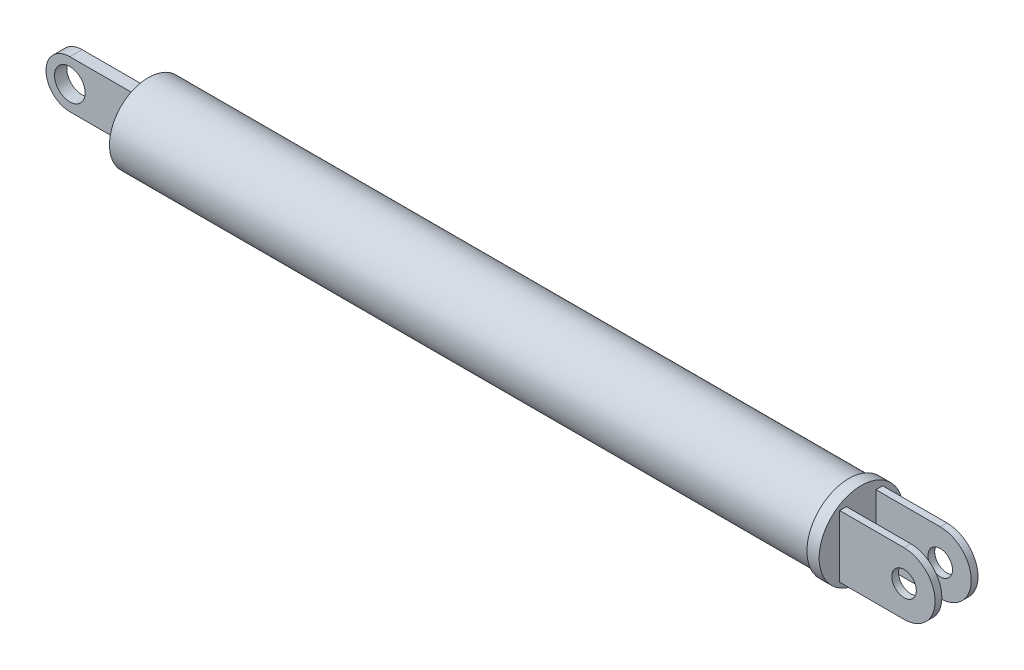
ISO-10303-21;
HEADER;
FILE_DESCRIPTION(('STEP AP214'),'2;1');
FILE_NAME('part.step','',(''),(''),'','','');
FILE_SCHEMA(('AUTOMOTIVE_DESIGN { 1 0 10303 214 1 1 1 1 }'));
ENDSEC;
DATA;
#1=APPLICATION_CONTEXT('core data for automotive mechanical design processes');
#2=APPLICATION_PROTOCOL_DEFINITION('international standard','automotive_design',2000,#1);
#3=PRODUCT_CONTEXT('',#1,'mechanical');
#4=PRODUCT('Part','Part','',(#3));
#5=PRODUCT_RELATED_PRODUCT_CATEGORY('part','',(#4));
#6=PRODUCT_DEFINITION_FORMATION('','',#4);
#7=PRODUCT_DEFINITION_CONTEXT('part definition',#1,'design');
#8=PRODUCT_DEFINITION('design','',#6,#7);
#9=PRODUCT_DEFINITION_SHAPE('','',#8);
#10=(LENGTH_UNIT() NAMED_UNIT(*) SI_UNIT(.MILLI.,.METRE.));
#11=(NAMED_UNIT(*) PLANE_ANGLE_UNIT() SI_UNIT($,.RADIAN.));
#12=(NAMED_UNIT(*) SI_UNIT($,.STERADIAN.) SOLID_ANGLE_UNIT());
#13=UNCERTAINTY_MEASURE_WITH_UNIT(LENGTH_MEASURE(1.E-05),#10,'distance_accuracy_value','');
#14=(GEOMETRIC_REPRESENTATION_CONTEXT(3) GLOBAL_UNCERTAINTY_ASSIGNED_CONTEXT((#13)) GLOBAL_UNIT_ASSIGNED_CONTEXT((#10,
#11,#12)) REPRESENTATION_CONTEXT('',''));
#15=CARTESIAN_POINT('',(0.,0.,0.));
#16=DIRECTION('',(0.,0.,1.));
#17=DIRECTION('',(1.,0.,0.));
#18=AXIS2_PLACEMENT_3D('',#15,#16,#17);
#19=CARTESIAN_POINT('',(232.6,-10.1328519164728,7.));
#20=DIRECTION('',(0.,1.,0.));
#21=DIRECTION('',(0.,0.,1.));
#22=AXIS2_PLACEMENT_3D('',#19,#20,#21);
#23=PLANE('',#22);
#24=DIRECTION('',(0.,0.,-1.));
#25=VECTOR('',#24,1.);
#26=CARTESIAN_POINT('',(253.6,-10.1328519164728,7.));
#27=LINE('',#26,#25);
#28=CARTESIAN_POINT('',(253.6,-10.1328519164728,-4.80121317375937));
#29=VERTEX_POINT('',#28);
#30=CARTESIAN_POINT('',(253.6,-10.1328519164728,-7.));
#31=VERTEX_POINT('',#30);
#32=EDGE_CURVE('E246',#29,#31,#27,.T.);
#33=ORIENTED_EDGE('',*,*,#32,.F.);
#34=DIRECTION('',(-1.,0.,0.));
#35=VECTOR('',#34,1.);
#36=CARTESIAN_POINT('',(232.6,-10.1328519164728,-4.80121317375936));
#37=LINE('',#36,#35);
#38=CARTESIAN_POINT('',(232.6,-10.1328519164728,-4.80121317375936));
#39=VERTEX_POINT('',#38);
#40=EDGE_CURVE('E215',#29,#39,#37,.T.);
#41=ORIENTED_EDGE('',*,*,#40,.T.);
#42=DIRECTION('',(0.,0.,-1.));
#43=VECTOR('',#42,1.);
#44=CARTESIAN_POINT('',(232.6,-10.1328519164728,7.));
#45=LINE('',#44,#43);
#46=CARTESIAN_POINT('',(232.6,-10.1328519164728,-7.));
#47=VERTEX_POINT('',#46);
#48=EDGE_CURVE('E148',#39,#47,#45,.T.);
#49=ORIENTED_EDGE('',*,*,#48,.T.);
#50=DIRECTION('',(1.,0.,0.));
#51=VECTOR('',#50,1.);
#52=CARTESIAN_POINT('',(232.6,-10.1328519164728,-7.));
#53=LINE('',#52,#51);
#54=EDGE_CURVE('E227',#47,#31,#53,.T.);
#55=ORIENTED_EDGE('',*,*,#54,.T.);
#56=EDGE_LOOP('',(#33,#41,#49,#55));
#57=FACE_BOUND('',#56,.T.);
#58=ADVANCED_FACE('F33',(#57),#23,.F.);
#59=CARTESIAN_POINT('',(253.6,0.,7.));
#60=DIRECTION('',(0.,0.,-1.));
#61=DIRECTION('',(-1.,0.,0.));
#62=AXIS2_PLACEMENT_3D('',#59,#60,#61);
#63=CYLINDRICAL_SURFACE('',#62,10.1328519164728);
#64=DIRECTION('',(0.,0.,-1.));
#65=VECTOR('',#64,1.);
#66=CARTESIAN_POINT('',(253.6,10.1328519164728,7.));
#67=LINE('',#66,#65);
#68=CARTESIAN_POINT('',(253.6,10.1328519164728,-4.80121317375937));
#69=VERTEX_POINT('',#68);
#70=CARTESIAN_POINT('',(253.6,10.1328519164728,-7.));
#71=VERTEX_POINT('',#70);
#72=EDGE_CURVE('E243',#69,#71,#67,.T.);
#73=ORIENTED_EDGE('',*,*,#72,.F.);
#74=CARTESIAN_POINT('',(253.6,0.,-4.80121317375937));
#75=DIRECTION('',(0.,0.,-1.));
#76=DIRECTION('',(-1.,0.,0.));
#77=AXIS2_PLACEMENT_3D('',#74,#75,#76);
#78=CIRCLE('',#77,10.1328519164728);
#79=EDGE_CURVE('E212',#69,#29,#78,.T.);
#80=ORIENTED_EDGE('',*,*,#79,.T.);
#81=ORIENTED_EDGE('',*,*,#32,.T.);
#82=CARTESIAN_POINT('',(253.6,0.,-7.));
#83=DIRECTION('',(0.,0.,1.));
#84=DIRECTION('',(-1.,0.,0.));
#85=AXIS2_PLACEMENT_3D('',#82,#83,#84);
#86=CIRCLE('',#85,10.1328519164728);
#87=EDGE_CURVE('E230',#31,#71,#86,.T.);
#88=ORIENTED_EDGE('',*,*,#87,.T.);
#89=EDGE_LOOP('',(#73,#80,#81,#88));
#90=FACE_BOUND('',#89,.T.);
#91=ADVANCED_FACE('F256',(#90),#63,.T.);
#92=CARTESIAN_POINT('',(232.6,10.1328519164728,7.));
#93=DIRECTION('',(0.,-1.,0.));
#94=DIRECTION('',(0.,0.,-1.));
#95=AXIS2_PLACEMENT_3D('',#92,#93,#94);
#96=PLANE('',#95);
#97=DIRECTION('',(0.,0.,-1.));
#98=VECTOR('',#97,1.);
#99=CARTESIAN_POINT('',(232.6,10.1328519164728,7.));
#100=LINE('',#99,#98);
#101=CARTESIAN_POINT('',(232.6,10.1328519164728,-4.80121317375936));
#102=VERTEX_POINT('',#101);
#103=CARTESIAN_POINT('',(232.6,10.1328519164728,-7.));
#104=VERTEX_POINT('',#103);
#105=EDGE_CURVE('E58',#102,#104,#100,.T.);
#106=ORIENTED_EDGE('',*,*,#105,.F.);
#107=DIRECTION('',(1.,0.,0.));
#108=VECTOR('',#107,1.);
#109=CARTESIAN_POINT('',(232.6,10.1328519164728,-4.80121317375936));
#110=LINE('',#109,#108);
#111=EDGE_CURVE('E209',#102,#69,#110,.T.);
#112=ORIENTED_EDGE('',*,*,#111,.T.);
#113=ORIENTED_EDGE('',*,*,#72,.T.);
#114=DIRECTION('',(-1.,0.,0.));
#115=VECTOR('',#114,1.);
#116=CARTESIAN_POINT('',(232.6,10.1328519164728,-7.));
#117=LINE('',#116,#115);
#118=EDGE_CURVE('E233',#71,#104,#117,.T.);
#119=ORIENTED_EDGE('',*,*,#118,.T.);
#120=EDGE_LOOP('',(#106,#112,#113,#119));
#121=FACE_BOUND('',#120,.T.);
#122=ADVANCED_FACE('F252',(#121),#96,.F.);
#123=CARTESIAN_POINT('',(253.6,0.,7.));
#124=DIRECTION('',(0.,0.,-1.));
#125=DIRECTION('',(-1.,0.,0.));
#126=AXIS2_PLACEMENT_3D('',#123,#124,#125);
#127=CYLINDRICAL_SURFACE('',#126,3.99999999999999);
#128=CARTESIAN_POINT('',(253.6,0.,-4.80121317375937));
#129=DIRECTION('',(0.,0.,-1.));
#130=DIRECTION('',(-1.,0.,0.));
#131=AXIS2_PLACEMENT_3D('',#128,#129,#130);
#132=CIRCLE('',#131,3.99999999999999);
#133=CARTESIAN_POINT('',(249.6,0.,-4.80121317375937));
#134=VERTEX_POINT('',#133);
#135=EDGE_CURVE('E37',#134,#134,#132,.T.);
#136=ORIENTED_EDGE('',*,*,#135,.F.);
#137=EDGE_LOOP('',(#136));
#138=FACE_BOUND('',#137,.T.);
#139=CARTESIAN_POINT('',(253.6,0.,-7.));
#140=DIRECTION('',(0.,0.,1.));
#141=DIRECTION('',(1.,0.,0.));
#142=AXIS2_PLACEMENT_3D('',#139,#140,#141);
#143=CIRCLE('',#142,3.99999999999999);
#144=CARTESIAN_POINT('',(257.6,0.,-7.));
#145=VERTEX_POINT('',#144);
#146=EDGE_CURVE('E218',#145,#145,#143,.T.);
#147=ORIENTED_EDGE('',*,*,#146,.F.);
#148=EDGE_LOOP('',(#147));
#149=FACE_BOUND('',#148,.T.);
#150=ADVANCED_FACE('F277',(#138,#149),#127,.F.);
#151=CARTESIAN_POINT('',(232.6,0.,0.));
#152=DIRECTION('',(1.,0.,0.));
#153=DIRECTION('',(0.,0.,-1.));
#154=AXIS2_PLACEMENT_3D('',#151,#152,#153);
#155=PLANE('',#154);
#156=ORIENTED_EDGE('',*,*,#48,.F.);
#157=DIRECTION('',(0.,1.,0.));
#158=VECTOR('',#157,1.);
#159=CARTESIAN_POINT('',(232.6,-13.7,-4.80121317375936));
#160=LINE('',#159,#158);
#161=EDGE_CURVE('E142',#39,#102,#160,.T.);
#162=ORIENTED_EDGE('',*,*,#161,.T.);
#163=ORIENTED_EDGE('',*,*,#105,.T.);
#164=DIRECTION('',(0.,-1.,0.));
#165=VECTOR('',#164,1.);
#166=CARTESIAN_POINT('',(232.6,10.1328519164728,-7.));
#167=LINE('',#166,#165);
#168=EDGE_CURVE('E225',#104,#47,#167,.T.);
#169=ORIENTED_EDGE('',*,*,#168,.T.);
#170=EDGE_LOOP('',(#156,#162,#163,#169));
#171=FACE_BOUND('',#170,.T.);
#172=CARTESIAN_POINT('',(232.6,10.1328519164728,7.));
#173=VERTEX_POINT('',#172);
#174=CARTESIAN_POINT('',(232.6,10.1328519164728,4.80121317375939));
#175=VERTEX_POINT('',#174);
#176=EDGE_CURVE('E141',#173,#175,#100,.T.);
#177=ORIENTED_EDGE('',*,*,#176,.T.);
#178=DIRECTION('',(0.,1.,0.));
#179=VECTOR('',#178,1.);
#180=CARTESIAN_POINT('',(232.6,-13.7,4.80121317375939));
#181=LINE('',#180,#179);
#182=CARTESIAN_POINT('',(232.6,-10.1328519164728,4.80121317375939));
#183=VERTEX_POINT('',#182);
#184=EDGE_CURVE('E50',#183,#175,#181,.T.);
#185=ORIENTED_EDGE('',*,*,#184,.F.);
#186=CARTESIAN_POINT('',(232.6,-10.1328519164728,7.));
#187=VERTEX_POINT('',#186);
#188=EDGE_CURVE('E139',#187,#183,#45,.T.);
#189=ORIENTED_EDGE('',*,*,#188,.F.);
#190=DIRECTION('',(0.,-1.,0.));
#191=VECTOR('',#190,1.);
#192=CARTESIAN_POINT('',(232.6,10.1328519164728,7.));
#193=LINE('',#192,#191);
#194=EDGE_CURVE('E236',#173,#187,#193,.T.);
#195=ORIENTED_EDGE('',*,*,#194,.F.);
#196=EDGE_LOOP('',(#177,#185,#189,#195));
#197=FACE_BOUND('',#196,.T.);
#198=CARTESIAN_POINT('',(232.6,0.,0.));
#199=DIRECTION('',(1.,0.,0.));
#200=DIRECTION('',(0.,0.,-1.));
#201=AXIS2_PLACEMENT_3D('',#198,#199,#200);
#202=CIRCLE('',#201,13.7);
#203=CARTESIAN_POINT('',(232.6,0.,-13.7));
#204=VERTEX_POINT('',#203);
#205=EDGE_CURVE('E152',#204,#204,#202,.T.);
#206=ORIENTED_EDGE('',*,*,#205,.T.);
#207=EDGE_LOOP('',(#206));
#208=FACE_BOUND('',#207,.T.);
#209=ADVANCED_FACE('F136',(#171,#197,#208),#155,.T.);
#210=CARTESIAN_POINT('',(0.,0.,0.));
#211=DIRECTION('',(1.,0.,0.));
#212=DIRECTION('',(0.,0.,-1.));
#213=AXIS2_PLACEMENT_3D('',#210,#211,#212);
#214=PLANE('',#213);
#215=CARTESIAN_POINT('',(0.,0.,0.));
#216=DIRECTION('',(1.,0.,0.));
#217=DIRECTION('',(0.,0.,-1.));
#218=AXIS2_PLACEMENT_3D('',#215,#216,#217);
#219=CIRCLE('',#218,12.7);
#220=CARTESIAN_POINT('',(0.,0.,-12.7));
#221=VERTEX_POINT('',#220);
#222=EDGE_CURVE('E42',#221,#221,#219,.T.);
#223=ORIENTED_EDGE('',*,*,#222,.F.);
#224=EDGE_LOOP('',(#223));
#225=FACE_BOUND('',#224,.T.);
#226=DIRECTION('',(0.,0.,-1.));
#227=VECTOR('',#226,1.);
#228=CARTESIAN_POINT('',(0.,7.77806758623207,2.));
#229=LINE('',#228,#227);
#230=CARTESIAN_POINT('',(0.,7.77806758623207,2.));
#231=VERTEX_POINT('',#230);
#232=CARTESIAN_POINT('',(0.,7.77806758623207,-2.));
#233=VERTEX_POINT('',#232);
#234=EDGE_CURVE('E194',#231,#233,#229,.T.);
#235=ORIENTED_EDGE('',*,*,#234,.F.);
#236=DIRECTION('',(0.,1.,0.));
#237=VECTOR('',#236,1.);
#238=CARTESIAN_POINT('',(0.,7.77806758623207,2.));
#239=LINE('',#238,#237);
#240=CARTESIAN_POINT('',(0.,-7.77806758623207,2.));
#241=VERTEX_POINT('',#240);
#242=EDGE_CURVE('E176',#241,#231,#239,.T.);
#243=ORIENTED_EDGE('',*,*,#242,.F.);
#244=DIRECTION('',(0.,0.,-1.));
#245=VECTOR('',#244,1.);
#246=CARTESIAN_POINT('',(0.,-7.77806758623207,2.));
#247=LINE('',#246,#245);
#248=CARTESIAN_POINT('',(0.,-7.77806758623207,-2.));
#249=VERTEX_POINT('',#248);
#250=EDGE_CURVE('E186',#241,#249,#247,.T.);
#251=ORIENTED_EDGE('',*,*,#250,.T.);
#252=DIRECTION('',(0.,1.,0.));
#253=VECTOR('',#252,1.);
#254=CARTESIAN_POINT('',(0.,7.77806758623207,-2.));
#255=LINE('',#254,#253);
#256=EDGE_CURVE('E167',#249,#233,#255,.T.);
#257=ORIENTED_EDGE('',*,*,#256,.T.);
#258=EDGE_LOOP('',(#235,#243,#251,#257));
#259=FACE_BOUND('',#258,.T.);
#260=ADVANCED_FACE('F313',(#225,#259),#214,.F.);
#261=CARTESIAN_POINT('',(228.6,0.,0.));
#262=DIRECTION('',(-1.,0.,0.));
#263=DIRECTION('',(0.,0.,1.));
#264=AXIS2_PLACEMENT_3D('',#261,#262,#263);
#265=CYLINDRICAL_SURFACE('',#264,12.7);
#266=CARTESIAN_POINT('',(228.6,0.,0.));
#267=DIRECTION('',(1.,0.,0.));
#268=DIRECTION('',(0.,0.,-1.));
#269=AXIS2_PLACEMENT_3D('',#266,#267,#268);
#270=CIRCLE('',#269,12.7);
#271=CARTESIAN_POINT('',(228.6,0.,-12.7));
#272=VERTEX_POINT('',#271);
#273=EDGE_CURVE('E11',#272,#272,#270,.T.);
#274=ORIENTED_EDGE('',*,*,#273,.F.);
#275=EDGE_LOOP('',(#274));
#276=FACE_BOUND('',#275,.T.);
#277=ORIENTED_EDGE('',*,*,#222,.T.);
#278=EDGE_LOOP('',(#277));
#279=FACE_BOUND('',#278,.T.);
#280=ADVANCED_FACE('F35',(#276,#279),#265,.T.);
#281=CARTESIAN_POINT('',(-23.6251254908995,0.,2.));
#282=DIRECTION('',(0.,0.,1.));
#283=DIRECTION('',(1.,0.,0.));
#284=AXIS2_PLACEMENT_3D('',#281,#282,#283);
#285=PLANE('',#284);
#286=ORIENTED_EDGE('',*,*,#242,.T.);
#287=DIRECTION('',(-1.,0.,0.));
#288=VECTOR('',#287,1.);
#289=CARTESIAN_POINT('',(0.,7.77806758623207,2.));
#290=LINE('',#289,#288);
#291=CARTESIAN_POINT('',(-23.6251254908995,7.77806758623206,2.));
#292=VERTEX_POINT('',#291);
#293=EDGE_CURVE('E179',#231,#292,#290,.T.);
#294=ORIENTED_EDGE('',*,*,#293,.T.);
#295=CARTESIAN_POINT('',(-23.6251254908995,0.,2.));
#296=DIRECTION('',(0.,0.,1.));
#297=DIRECTION('',(1.,0.,0.));
#298=AXIS2_PLACEMENT_3D('',#295,#296,#297);
#299=CIRCLE('',#298,7.77806758623206);
#300=CARTESIAN_POINT('',(-23.6251254908995,-7.77806758623207,2.));
#301=VERTEX_POINT('',#300);
#302=EDGE_CURVE('E181',#292,#301,#299,.T.);
#303=ORIENTED_EDGE('',*,*,#302,.T.);
#304=DIRECTION('',(1.,0.,0.));
#305=VECTOR('',#304,1.);
#306=CARTESIAN_POINT('',(0.,-7.77806758623207,2.));
#307=LINE('',#306,#305);
#308=EDGE_CURVE('E183',#301,#241,#307,.T.);
#309=ORIENTED_EDGE('',*,*,#308,.T.);
#310=EDGE_LOOP('',(#286,#294,#303,#309));
#311=FACE_BOUND('',#310,.T.);
#312=CARTESIAN_POINT('',(-23.6251254908995,0.,2.));
#313=DIRECTION('',(0.,0.,1.));
#314=DIRECTION('',(1.,0.,0.));
#315=AXIS2_PLACEMENT_3D('',#312,#313,#314);
#316=CIRCLE('',#315,5.);
#317=CARTESIAN_POINT('',(-18.6251254908995,0.,2.));
#318=VERTEX_POINT('',#317);
#319=EDGE_CURVE('E163',#318,#318,#316,.T.);
#320=ORIENTED_EDGE('',*,*,#319,.F.);
#321=EDGE_LOOP('',(#320));
#322=FACE_BOUND('',#321,.T.);
#323=ADVANCED_FACE('F336',(#311,#322),#285,.T.);
#324=CARTESIAN_POINT('',(-23.6251254908995,0.,-2.));
#325=DIRECTION('',(0.,0.,1.));
#326=DIRECTION('',(1.,0.,0.));
#327=AXIS2_PLACEMENT_3D('',#324,#325,#326);
#328=PLANE('',#327);
#329=ORIENTED_EDGE('',*,*,#256,.F.);
#330=DIRECTION('',(1.,0.,0.));
#331=VECTOR('',#330,1.);
#332=CARTESIAN_POINT('',(0.,-7.77806758623207,-2.));
#333=LINE('',#332,#331);
#334=CARTESIAN_POINT('',(-23.6251254908995,-7.77806758623207,-2.));
#335=VERTEX_POINT('',#334);
#336=EDGE_CURVE('E173',#335,#249,#333,.T.);
#337=ORIENTED_EDGE('',*,*,#336,.F.);
#338=CARTESIAN_POINT('',(-23.6251254908995,0.,-2.));
#339=DIRECTION('',(0.,0.,1.));
#340=DIRECTION('',(1.,0.,0.));
#341=AXIS2_PLACEMENT_3D('',#338,#339,#340);
#342=CIRCLE('',#341,7.77806758623206);
#343=CARTESIAN_POINT('',(-23.6251254908995,7.77806758623206,-2.));
#344=VERTEX_POINT('',#343);
#345=EDGE_CURVE('E171',#344,#335,#342,.T.);
#346=ORIENTED_EDGE('',*,*,#345,.F.);
#347=DIRECTION('',(-1.,0.,0.));
#348=VECTOR('',#347,1.);
#349=CARTESIAN_POINT('',(0.,7.77806758623207,-2.));
#350=LINE('',#349,#348);
#351=EDGE_CURVE('E169',#233,#344,#350,.T.);
#352=ORIENTED_EDGE('',*,*,#351,.F.);
#353=EDGE_LOOP('',(#329,#337,#346,#352));
#354=FACE_BOUND('',#353,.T.);
#355=CARTESIAN_POINT('',(-23.6251254908995,0.,-2.));
#356=DIRECTION('',(0.,0.,1.));
#357=DIRECTION('',(1.,0.,0.));
#358=AXIS2_PLACEMENT_3D('',#355,#356,#357);
#359=CIRCLE('',#358,5.);
#360=CARTESIAN_POINT('',(-18.6251254908995,0.,-2.));
#361=VERTEX_POINT('',#360);
#362=EDGE_CURVE('E160',#361,#361,#359,.T.);
#363=ORIENTED_EDGE('',*,*,#362,.T.);
#364=EDGE_LOOP('',(#363));
#365=FACE_BOUND('',#364,.T.);
#366=ADVANCED_FACE('F332',(#354,#365),#328,.F.);
#367=CARTESIAN_POINT('',(0.,7.77806758623207,2.));
#368=DIRECTION('',(0.,-1.,0.));
#369=DIRECTION('',(1.,0.,0.));
#370=AXIS2_PLACEMENT_3D('',#367,#368,#369);
#371=PLANE('',#370);
#372=ORIENTED_EDGE('',*,*,#351,.T.);
#373=DIRECTION('',(0.,0.,-1.));
#374=VECTOR('',#373,1.);
#375=CARTESIAN_POINT('',(-23.6251254908995,7.77806758623206,2.));
#376=LINE('',#375,#374);
#377=EDGE_CURVE('E191',#292,#344,#376,.T.);
#378=ORIENTED_EDGE('',*,*,#377,.F.);
#379=ORIENTED_EDGE('',*,*,#293,.F.);
#380=ORIENTED_EDGE('',*,*,#234,.T.);
#381=EDGE_LOOP('',(#372,#378,#379,#380));
#382=FACE_BOUND('',#381,.T.);
#383=ADVANCED_FACE('F335',(#382),#371,.F.);
#384=CARTESIAN_POINT('',(-23.6251254908995,0.,2.));
#385=DIRECTION('',(0.,0.,-1.));
#386=DIRECTION('',(-1.,0.,0.));
#387=AXIS2_PLACEMENT_3D('',#384,#385,#386);
#388=CYLINDRICAL_SURFACE('',#387,7.77806758623206);
#389=ORIENTED_EDGE('',*,*,#345,.T.);
#390=DIRECTION('',(0.,0.,-1.));
#391=VECTOR('',#390,1.);
#392=CARTESIAN_POINT('',(-23.6251254908995,-7.77806758623207,2.));
#393=LINE('',#392,#391);
#394=EDGE_CURVE('E188',#301,#335,#393,.T.);
#395=ORIENTED_EDGE('',*,*,#394,.F.);
#396=ORIENTED_EDGE('',*,*,#302,.F.);
#397=ORIENTED_EDGE('',*,*,#377,.T.);
#398=EDGE_LOOP('',(#389,#395,#396,#397));
#399=FACE_BOUND('',#398,.T.);
#400=ADVANCED_FACE('F343',(#399),#388,.T.);
#401=CARTESIAN_POINT('',(0.,-7.77806758623207,2.));
#402=DIRECTION('',(0.,1.,0.));
#403=DIRECTION('',(-1.,0.,0.));
#404=AXIS2_PLACEMENT_3D('',#401,#402,#403);
#405=PLANE('',#404);
#406=ORIENTED_EDGE('',*,*,#336,.T.);
#407=ORIENTED_EDGE('',*,*,#250,.F.);
#408=ORIENTED_EDGE('',*,*,#308,.F.);
#409=ORIENTED_EDGE('',*,*,#394,.T.);
#410=EDGE_LOOP('',(#406,#407,#408,#409));
#411=FACE_BOUND('',#410,.T.);
#412=ADVANCED_FACE('F330',(#411),#405,.F.);
#413=CARTESIAN_POINT('',(-23.6251254908995,0.,2.));
#414=DIRECTION('',(0.,0.,-1.));
#415=DIRECTION('',(-1.,0.,0.));
#416=AXIS2_PLACEMENT_3D('',#413,#414,#415);
#417=CYLINDRICAL_SURFACE('',#416,5.);
#418=ORIENTED_EDGE('',*,*,#319,.T.);
#419=EDGE_LOOP('',(#418));
#420=FACE_BOUND('',#419,.T.);
#421=ORIENTED_EDGE('',*,*,#362,.F.);
#422=EDGE_LOOP('',(#421));
#423=FACE_BOUND('',#422,.T.);
#424=ADVANCED_FACE('F327',(#420,#423),#417,.F.);
#425=CARTESIAN_POINT('',(228.6,0.,0.));
#426=DIRECTION('',(1.,0.,0.));
#427=DIRECTION('',(0.,0.,-1.));
#428=AXIS2_PLACEMENT_3D('',#425,#426,#427);
#429=PLANE('',#428);
#430=CARTESIAN_POINT('',(228.6,0.,0.));
#431=DIRECTION('',(1.,0.,0.));
#432=DIRECTION('',(0.,0.,-1.));
#433=AXIS2_PLACEMENT_3D('',#430,#431,#432);
#434=CIRCLE('',#433,13.7);
#435=CARTESIAN_POINT('',(228.6,0.,-13.7));
#436=VERTEX_POINT('',#435);
#437=EDGE_CURVE('E147',#436,#436,#434,.T.);
#438=ORIENTED_EDGE('',*,*,#437,.F.);
#439=EDGE_LOOP('',(#438));
#440=FACE_BOUND('',#439,.T.);
#441=ORIENTED_EDGE('',*,*,#273,.T.);
#442=EDGE_LOOP('',(#441));
#443=FACE_BOUND('',#442,.T.);
#444=ADVANCED_FACE('F323',(#440,#443),#429,.F.);
#445=CARTESIAN_POINT('',(232.6,0.,0.));
#446=DIRECTION('',(-1.,0.,0.));
#447=DIRECTION('',(0.,0.,1.));
#448=AXIS2_PLACEMENT_3D('',#445,#446,#447);
#449=CYLINDRICAL_SURFACE('',#448,13.7);
#450=ORIENTED_EDGE('',*,*,#205,.F.);
#451=EDGE_LOOP('',(#450));
#452=FACE_BOUND('',#451,.T.);
#453=ORIENTED_EDGE('',*,*,#437,.T.);
#454=EDGE_LOOP('',(#453));
#455=FACE_BOUND('',#454,.T.);
#456=ADVANCED_FACE('F298',(#452,#455),#449,.T.);
#457=CARTESIAN_POINT('',(253.6,0.,7.));
#458=DIRECTION('',(0.,0.,-1.));
#459=DIRECTION('',(-1.,0.,0.));
#460=AXIS2_PLACEMENT_3D('',#457,#458,#459);
#461=PLANE('',#460);
#462=ORIENTED_EDGE('',*,*,#194,.T.);
#463=DIRECTION('',(1.,0.,0.));
#464=VECTOR('',#463,1.);
#465=CARTESIAN_POINT('',(232.6,-10.1328519164728,7.));
#466=LINE('',#465,#464);
#467=CARTESIAN_POINT('',(253.6,-10.1328519164728,7.));
#468=VERTEX_POINT('',#467);
#469=EDGE_CURVE('E145',#187,#468,#466,.T.);
#470=ORIENTED_EDGE('',*,*,#469,.T.);
#471=CARTESIAN_POINT('',(253.6,0.,7.));
#472=DIRECTION('',(0.,0.,1.));
#473=DIRECTION('',(-1.,0.,0.));
#474=AXIS2_PLACEMENT_3D('',#471,#472,#473);
#475=CIRCLE('',#474,10.1328519164728);
#476=CARTESIAN_POINT('',(253.6,10.1328519164728,7.));
#477=VERTEX_POINT('',#476);
#478=EDGE_CURVE('E239',#468,#477,#475,.T.);
#479=ORIENTED_EDGE('',*,*,#478,.T.);
#480=DIRECTION('',(-1.,0.,0.));
#481=VECTOR('',#480,1.);
#482=CARTESIAN_POINT('',(232.6,10.1328519164728,7.));
#483=LINE('',#482,#481);
#484=EDGE_CURVE('E241',#477,#173,#483,.T.);
#485=ORIENTED_EDGE('',*,*,#484,.T.);
#486=EDGE_LOOP('',(#462,#470,#479,#485));
#487=FACE_BOUND('',#486,.T.);
#488=CARTESIAN_POINT('',(253.6,0.,7.));
#489=DIRECTION('',(0.,0.,1.));
#490=DIRECTION('',(1.,0.,0.));
#491=AXIS2_PLACEMENT_3D('',#488,#489,#490);
#492=CIRCLE('',#491,3.99999999999999);
#493=CARTESIAN_POINT('',(257.6,0.,7.));
#494=VERTEX_POINT('',#493);
#495=EDGE_CURVE('E221',#494,#494,#492,.T.);
#496=ORIENTED_EDGE('',*,*,#495,.F.);
#497=EDGE_LOOP('',(#496));
#498=FACE_BOUND('',#497,.T.);
#499=ADVANCED_FACE('F293',(#487,#498),#461,.F.);
#500=CARTESIAN_POINT('',(253.6,0.,-7.));
#501=DIRECTION('',(0.,0.,-1.));
#502=DIRECTION('',(-1.,0.,0.));
#503=AXIS2_PLACEMENT_3D('',#500,#501,#502);
#504=PLANE('',#503);
#505=ORIENTED_EDGE('',*,*,#168,.F.);
#506=ORIENTED_EDGE('',*,*,#118,.F.);
#507=ORIENTED_EDGE('',*,*,#87,.F.);
#508=ORIENTED_EDGE('',*,*,#54,.F.);
#509=EDGE_LOOP('',(#505,#506,#507,#508));
#510=FACE_BOUND('',#509,.T.);
#511=ORIENTED_EDGE('',*,*,#146,.T.);
#512=EDGE_LOOP('',(#511));
#513=FACE_BOUND('',#512,.T.);
#514=ADVANCED_FACE('F260',(#510,#513),#504,.T.);
#515=ORIENTED_EDGE('',*,*,#188,.T.);
#516=DIRECTION('',(1.,0.,0.));
#517=VECTOR('',#516,1.);
#518=CARTESIAN_POINT('',(232.6,-10.1328519164728,4.80121317375939));
#519=LINE('',#518,#517);
#520=CARTESIAN_POINT('',(253.6,-10.1328519164728,4.80121317375939));
#521=VERTEX_POINT('',#520);
#522=EDGE_CURVE('E124',#183,#521,#519,.T.);
#523=ORIENTED_EDGE('',*,*,#522,.T.);
#524=EDGE_CURVE('E154',#468,#521,#27,.T.);
#525=ORIENTED_EDGE('',*,*,#524,.F.);
#526=ORIENTED_EDGE('',*,*,#469,.F.);
#527=EDGE_LOOP('',(#515,#523,#525,#526));
#528=FACE_BOUND('',#527,.T.);
#529=ADVANCED_FACE('F144',(#528),#23,.F.);
#530=ORIENTED_EDGE('',*,*,#524,.T.);
#531=CARTESIAN_POINT('',(253.6,0.,4.80121317375939));
#532=DIRECTION('',(0.,0.,1.));
#533=DIRECTION('',(1.,0.,0.));
#534=AXIS2_PLACEMENT_3D('',#531,#532,#533);
#535=CIRCLE('',#534,10.1328519164728);
#536=CARTESIAN_POINT('',(253.6,10.1328519164728,4.80121317375939));
#537=VERTEX_POINT('',#536);
#538=EDGE_CURVE('E127',#521,#537,#535,.T.);
#539=ORIENTED_EDGE('',*,*,#538,.T.);
#540=EDGE_CURVE('E244',#477,#537,#67,.T.);
#541=ORIENTED_EDGE('',*,*,#540,.F.);
#542=ORIENTED_EDGE('',*,*,#478,.F.);
#543=EDGE_LOOP('',(#530,#539,#541,#542));
#544=FACE_BOUND('',#543,.T.);
#545=ADVANCED_FACE('F285',(#544),#63,.T.);
#546=ORIENTED_EDGE('',*,*,#540,.T.);
#547=DIRECTION('',(-1.,0.,0.));
#548=VECTOR('',#547,1.);
#549=CARTESIAN_POINT('',(232.6,10.1328519164728,4.80121317375939));
#550=LINE('',#549,#548);
#551=EDGE_CURVE('E201',#537,#175,#550,.T.);
#552=ORIENTED_EDGE('',*,*,#551,.T.);
#553=ORIENTED_EDGE('',*,*,#176,.F.);
#554=ORIENTED_EDGE('',*,*,#484,.F.);
#555=EDGE_LOOP('',(#546,#552,#553,#554));
#556=FACE_BOUND('',#555,.T.);
#557=ADVANCED_FACE('F274',(#556),#96,.F.);
#558=CARTESIAN_POINT('',(253.6,0.,4.80121317375939));
#559=DIRECTION('',(0.,0.,1.));
#560=DIRECTION('',(1.,0.,0.));
#561=AXIS2_PLACEMENT_3D('',#558,#559,#560);
#562=CIRCLE('',#561,3.99999999999999);
#563=CARTESIAN_POINT('',(257.6,0.,4.80121317375939));
#564=VERTEX_POINT('',#563);
#565=EDGE_CURVE('E199',#564,#564,#562,.T.);
#566=ORIENTED_EDGE('',*,*,#565,.F.);
#567=EDGE_LOOP('',(#566));
#568=FACE_BOUND('',#567,.T.);
#569=ORIENTED_EDGE('',*,*,#495,.T.);
#570=EDGE_LOOP('',(#569));
#571=FACE_BOUND('',#570,.T.);
#572=ADVANCED_FACE('F266',(#568,#571),#127,.F.);
#573=CARTESIAN_POINT('',(232.6,-13.7,-4.80121317375936));
#574=DIRECTION('',(0.,0.,-1.));
#575=DIRECTION('',(-1.,0.,0.));
#576=AXIS2_PLACEMENT_3D('',#573,#574,#575);
#577=PLANE('',#576);
#578=ORIENTED_EDGE('',*,*,#135,.T.);
#579=EDGE_LOOP('',(#578));
#580=FACE_BOUND('',#579,.T.);
#581=ORIENTED_EDGE('',*,*,#79,.F.);
#582=ORIENTED_EDGE('',*,*,#111,.F.);
#583=ORIENTED_EDGE('',*,*,#161,.F.);
#584=ORIENTED_EDGE('',*,*,#40,.F.);
#585=EDGE_LOOP('',(#581,#582,#583,#584));
#586=FACE_BOUND('',#585,.T.);
#587=ADVANCED_FACE('F264',(#580,#586),#577,.F.);
#588=CARTESIAN_POINT('',(232.6,-13.7,4.80121317375939));
#589=DIRECTION('',(0.,0.,1.));
#590=DIRECTION('',(1.,0.,0.));
#591=AXIS2_PLACEMENT_3D('',#588,#589,#590);
#592=PLANE('',#591);
#593=ORIENTED_EDGE('',*,*,#565,.T.);
#594=EDGE_LOOP('',(#593));
#595=FACE_BOUND('',#594,.T.);
#596=ORIENTED_EDGE('',*,*,#184,.T.);
#597=ORIENTED_EDGE('',*,*,#551,.F.);
#598=ORIENTED_EDGE('',*,*,#538,.F.);
#599=ORIENTED_EDGE('',*,*,#522,.F.);
#600=EDGE_LOOP('',(#596,#597,#598,#599));
#601=FACE_BOUND('',#600,.T.);
#602=ADVANCED_FACE('F125',(#595,#601),#592,.F.);
#603=CLOSED_SHELL('',(#58,#91,#122,#150,#209,#260,#280,#323,#366,#383,#400,#412,#424,#444,#456,
#499,#514,#529,#545,#557,#572,#587,#602));
#604=MANIFOLD_SOLID_BREP('B2',#603);
#605=ADVANCED_BREP_SHAPE_REPRESENTATION('',(#18,#604),#14);
#606=SHAPE_DEFINITION_REPRESENTATION(#9,#605);
ENDSEC;
END-ISO-10303-21;
